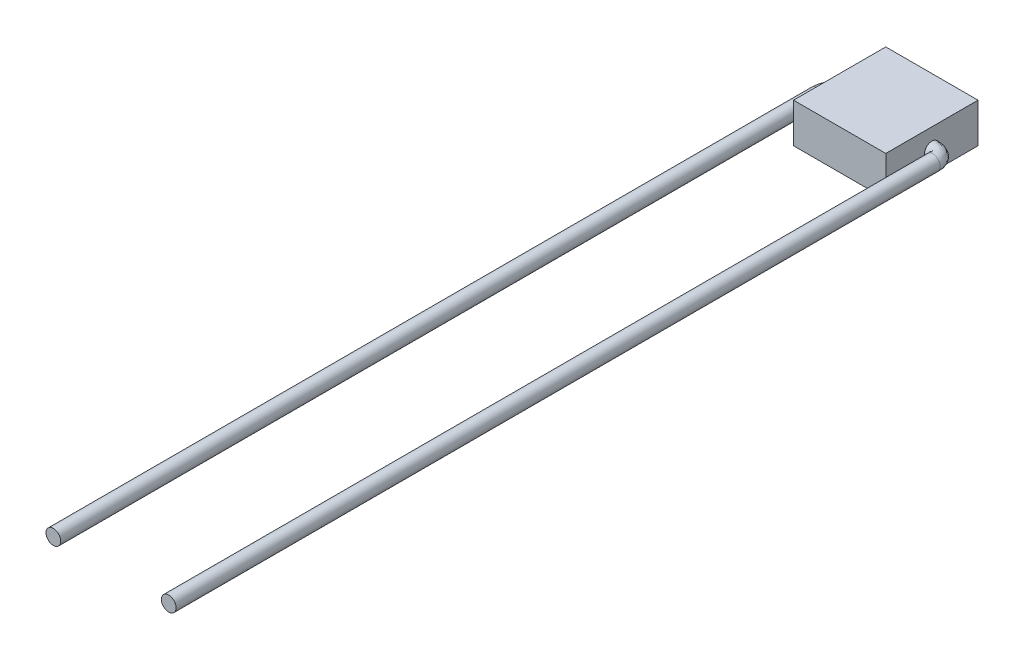
ISO-10303-21;
HEADER;
FILE_DESCRIPTION(('STEP AP214'),'2;1');
FILE_NAME('part.step','',(''),(''),'','','');
FILE_SCHEMA(('AUTOMOTIVE_DESIGN { 1 0 10303 214 1 1 1 1 }'));
ENDSEC;
DATA;
#1=APPLICATION_CONTEXT('core data for automotive mechanical design processes');
#2=APPLICATION_PROTOCOL_DEFINITION('international standard','automotive_design',2000,#1);
#3=PRODUCT_CONTEXT('',#1,'mechanical');
#4=PRODUCT('Part','Part','',(#3));
#5=PRODUCT_RELATED_PRODUCT_CATEGORY('part','',(#4));
#6=PRODUCT_DEFINITION_FORMATION('','',#4);
#7=PRODUCT_DEFINITION_CONTEXT('part definition',#1,'design');
#8=PRODUCT_DEFINITION('design','',#6,#7);
#9=PRODUCT_DEFINITION_SHAPE('','',#8);
#10=(LENGTH_UNIT() NAMED_UNIT(*) SI_UNIT(.MILLI.,.METRE.));
#11=(NAMED_UNIT(*) PLANE_ANGLE_UNIT() SI_UNIT($,.RADIAN.));
#12=(NAMED_UNIT(*) SI_UNIT($,.STERADIAN.) SOLID_ANGLE_UNIT());
#13=UNCERTAINTY_MEASURE_WITH_UNIT(LENGTH_MEASURE(1.E-05),#10,'distance_accuracy_value','');
#14=(GEOMETRIC_REPRESENTATION_CONTEXT(3) GLOBAL_UNCERTAINTY_ASSIGNED_CONTEXT((#13)) GLOBAL_UNIT_ASSIGNED_CONTEXT((#10,
#11,#12)) REPRESENTATION_CONTEXT('',''));
#15=CARTESIAN_POINT('',(0.,0.,0.));
#16=DIRECTION('',(0.,0.,1.));
#17=DIRECTION('',(1.,0.,0.));
#18=AXIS2_PLACEMENT_3D('',#15,#16,#17);
#19=CARTESIAN_POINT('',(-3.501,1.5,-0.559999999999999));
#20=CARTESIAN_POINT('',(-3.57077086192538,1.5,-0.55747201386203));
#21=CARTESIAN_POINT('',(-3.70464029487485,1.5,-0.552621563954215));
#22=CARTESIAN_POINT('',(-3.91057383124204,1.5,-0.522110787828596));
#23=CARTESIAN_POINT('',(-4.11066868138705,1.5,-0.46971702106323));
#24=CARTESIAN_POINT('',(-4.30488379513025,1.5,-0.388880832683943));
#25=CARTESIAN_POINT('',(-4.48850437092492,1.5,-0.274175744233258));
#26=CARTESIAN_POINT('',(-4.66106295964431,1.5,-0.114314040815334));
#27=CARTESIAN_POINT('',(-4.80258904414648,1.5,0.0902926027950877));
#28=CARTESIAN_POINT('',(-4.89704986157643,1.5,0.331803945338373));
#29=CARTESIAN_POINT('',(-4.9407636821338,1.5,0.578221966011214));
#30=CARTESIAN_POINT('',(-4.93808150430951,1.5,0.730850955853715));
#31=CARTESIAN_POINT('',(-4.93668627987886,1.5,0.8102460256088));
#32=CARTESIAN_POINT('',(-3.501,2.62,-0.559999999999999));
#33=CARTESIAN_POINT('',(-3.57077086192538,2.62,-0.55747201386203));
#34=CARTESIAN_POINT('',(-3.70464029487485,2.62,-0.552621563954216));
#35=CARTESIAN_POINT('',(-3.91057383124204,2.62,-0.522110787828596));
#36=CARTESIAN_POINT('',(-4.11066868138705,2.62,-0.469717021063229));
#37=CARTESIAN_POINT('',(-4.30488379513026,2.62,-0.388880832683943));
#38=CARTESIAN_POINT('',(-4.48850437092491,2.62,-0.274175744233258));
#39=CARTESIAN_POINT('',(-4.66106295964431,2.62,-0.114314040815333));
#40=CARTESIAN_POINT('',(-4.80258904414648,2.62,0.0902926027950873));
#41=CARTESIAN_POINT('',(-4.89704986157643,2.62,0.331803945338373));
#42=CARTESIAN_POINT('',(-4.9407636821338,2.62,0.578221966011214));
#43=CARTESIAN_POINT('',(-4.93808150430951,2.62,0.730850955853715));
#44=CARTESIAN_POINT('',(-4.93668627987886,2.62,0.8102460256088));
#45=CARTESIAN_POINT('',(-3.501,2.62,0.560000000000001));
#46=CARTESIAN_POINT('',(-3.5410215522219,2.62,0.561978864055828));
#47=CARTESIAN_POINT('',(-3.61781095045856,2.62,0.565775712793645));
#48=CARTESIAN_POINT('',(-3.70798338071088,2.62,0.581838897980365));
#49=CARTESIAN_POINT('',(-3.77086219618417,2.62,0.601230132123268));
#50=CARTESIAN_POINT('',(-3.80597549757706,2.62,0.619546499124088));
#51=CARTESIAN_POINT('',(-3.81795400080961,2.62,0.631204501510863));
#52=CARTESIAN_POINT('',(-3.81607223827673,2.62,0.634389914440076));
#53=CARTESIAN_POINT('',(-3.81172378294138,2.62,0.633227530091476));
#54=CARTESIAN_POINT('',(-3.8145648973864,2.62,0.647233205299211));
#55=CARTESIAN_POINT('',(-3.82117636953188,2.62,0.691295370718697));
#56=CARTESIAN_POINT('',(-3.81852568511852,2.62,0.746864061766419));
#57=CARTESIAN_POINT('',(-3.81714684303803,2.62,0.775769973457804));
#58=CARTESIAN_POINT('',(-3.501,1.5,0.560000000000001));
#59=CARTESIAN_POINT('',(-3.5410215522219,1.5,0.561978864055829));
#60=CARTESIAN_POINT('',(-3.61781095045856,1.5,0.565775712793645));
#61=CARTESIAN_POINT('',(-3.70798338071088,1.5,0.581838897980364));
#62=CARTESIAN_POINT('',(-3.77086219618417,1.5,0.601230132123269));
#63=CARTESIAN_POINT('',(-3.80597549757706,1.5,0.619546499124087));
#64=CARTESIAN_POINT('',(-3.81795400080961,1.5,0.631204501510863));
#65=CARTESIAN_POINT('',(-3.81607223827673,1.5,0.634389914440077));
#66=CARTESIAN_POINT('',(-3.81172378294138,1.5,0.633227530091476));
#67=CARTESIAN_POINT('',(-3.8145648973864,1.5,0.647233205299211));
#68=CARTESIAN_POINT('',(-3.82117636953188,1.5,0.691295370718697));
#69=CARTESIAN_POINT('',(-3.81852568511852,1.5,0.746864061766419));
#70=CARTESIAN_POINT('',(-3.81714684303803,1.5,0.775769973457804));
#71=CARTESIAN_POINT('',(-3.501,0.38,0.560000000000001));
#72=CARTESIAN_POINT('',(-3.5410215522219,0.38,0.561978864055829));
#73=CARTESIAN_POINT('',(-3.61781095045856,0.38,0.565775712793645));
#74=CARTESIAN_POINT('',(-3.70798338071088,0.38,0.581838897980365));
#75=CARTESIAN_POINT('',(-3.77086219618417,0.38,0.601230132123268));
#76=CARTESIAN_POINT('',(-3.80597549757706,0.38,0.619546499124088));
#77=CARTESIAN_POINT('',(-3.81795400080961,0.38,0.631204501510863));
#78=CARTESIAN_POINT('',(-3.81607223827673,0.38,0.634389914440078));
#79=CARTESIAN_POINT('',(-3.81172378294138,0.38,0.633227530091476));
#80=CARTESIAN_POINT('',(-3.8145648973864,0.38,0.647233205299211));
#81=CARTESIAN_POINT('',(-3.82117636953188,0.38,0.691295370718697));
#82=CARTESIAN_POINT('',(-3.81852568511852,0.38,0.746864061766419));
#83=CARTESIAN_POINT('',(-3.81714684303803,0.38,0.775769973457804));
#84=CARTESIAN_POINT('',(-3.501,0.38,-0.559999999999999));
#85=CARTESIAN_POINT('',(-3.57077086192538,0.38,-0.55747201386203));
#86=CARTESIAN_POINT('',(-3.70464029487485,0.38,-0.552621563954216));
#87=CARTESIAN_POINT('',(-3.91057383124204,0.38,-0.522110787828596));
#88=CARTESIAN_POINT('',(-4.11066868138705,0.38,-0.469717021063229));
#89=CARTESIAN_POINT('',(-4.30488379513026,0.38,-0.388880832683943));
#90=CARTESIAN_POINT('',(-4.48850437092491,0.38,-0.274175744233258));
#91=CARTESIAN_POINT('',(-4.66106295964431,0.38,-0.114314040815333));
#92=CARTESIAN_POINT('',(-4.80258904414648,0.38,0.0902926027950873));
#93=CARTESIAN_POINT('',(-4.89704986157643,0.38,0.331803945338373));
#94=CARTESIAN_POINT('',(-4.9407636821338,0.38,0.578221966011214));
#95=CARTESIAN_POINT('',(-4.93808150430951,0.38,0.730850955853715));
#96=CARTESIAN_POINT('',(-4.93668627987886,0.38,0.8102460256088));
#97=CARTESIAN_POINT('',(-3.501,1.5,-0.559999999999999));
#98=CARTESIAN_POINT('',(-3.57077086192538,1.5,-0.55747201386203));
#99=CARTESIAN_POINT('',(-3.70464029487485,1.5,-0.552621563954215));
#100=CARTESIAN_POINT('',(-3.91057383124204,1.5,-0.522110787828596));
#101=CARTESIAN_POINT('',(-4.11066868138705,1.5,-0.46971702106323));
#102=CARTESIAN_POINT('',(-4.30488379513025,1.5,-0.388880832683943));
#103=CARTESIAN_POINT('',(-4.48850437092492,1.5,-0.274175744233258));
#104=CARTESIAN_POINT('',(-4.66106295964431,1.5,-0.114314040815334));
#105=CARTESIAN_POINT('',(-4.80258904414648,1.5,0.0902926027950877));
#106=CARTESIAN_POINT('',(-4.89704986157643,1.5,0.331803945338373));
#107=CARTESIAN_POINT('',(-4.9407636821338,1.5,0.578221966011214));
#108=CARTESIAN_POINT('',(-4.93808150430951,1.5,0.730850955853715));
#109=CARTESIAN_POINT('',(-4.93668627987886,1.5,0.8102460256088));
#110=(BOUNDED_SURFACE() B_SPLINE_SURFACE(3,3,((#19,#20,#21,#22,#23,#24,#25,#26,#27,#28,#29,#30,
#31),(#32,#33,#34,#35,#36,#37,#38,#39,#40,#41,#42,#43,#44),(#45,#46,#47,#48,#49,#50,#51,#52,#53,
#54,#55,#56,#57),(#58,#59,#60,#61,#62,#63,#64,#65,#66,#67,#68,#69,#70),(#71,#72,#73,#74,#75,#76,
#77,#78,#79,#80,#81,#82,#83),(#84,#85,#86,#87,#88,#89,#90,#91,#92,#93,#94,#95,#96),(#97,#98,#99,
#100,#101,#102,#103,#104,#105,#106,#107,#108,#109)),.UNSPECIFIED.,.T.,.F.,
.F.) B_SPLINE_SURFACE_WITH_KNOTS((4,3,4),(4,1,1,1,1,1,1,1,1,1,4),(0.,0.5,1.),(0.,
0.114428463898639,0.219554025171337,0.31668162093328,0.407421828969413,0.493658937883064,
0.577638288077974,0.676716960010985,0.777579057968776,0.88430031394571,1.),
.UNSPECIFIED.) GEOMETRIC_REPRESENTATION_ITEM() RATIONAL_B_SPLINE_SURFACE(((1.,1.,1.,1.,1.,1.,1.,
1.,1.,1.,1.,1.,1.),(0.333333333333333,0.333333333333333,0.333333333333333,0.333333333333333,
0.333333333333333,0.333333333333333,0.333333333333333,0.333333333333333,0.333333333333333,
0.333333333333333,0.333333333333333,0.333333333333333,0.333333333333333),(0.333333333333333,
0.333333333333333,0.333333333333333,0.333333333333333,0.333333333333333,0.333333333333333,
0.333333333333333,0.333333333333333,0.333333333333333,0.333333333333333,0.333333333333333,
0.333333333333333,0.333333333333333),(1.,1.,1.,1.,1.,1.,1.,1.,1.,1.,1.,1.,1.),
(0.333333333333333,0.333333333333333,0.333333333333333,0.333333333333333,0.333333333333333,
0.333333333333333,0.333333333333333,0.333333333333333,0.333333333333333,0.333333333333333,
0.333333333333333,0.333333333333333,0.333333333333333),(0.333333333333333,0.333333333333333,
0.333333333333333,0.333333333333333,0.333333333333333,0.333333333333333,0.333333333333333,
0.333333333333333,0.333333333333333,0.333333333333333,0.333333333333333,0.333333333333333,
0.333333333333333),(1.,1.,1.,1.,1.,1.,1.,1.,1.,1.,1.,1.,1.))) REPRESENTATION_ITEM('') SURFACE());
#111=CARTESIAN_POINT('',(-3.501,1.5,0.));
#112=DIRECTION('',(1.,0.,0.));
#113=DIRECTION('',(0.,0.,-1.));
#114=AXIS2_PLACEMENT_3D('',#111,#112,#113);
#115=CIRCLE('',#114,0.56);
#116=CARTESIAN_POINT('',(-3.501,1.5,-0.559999999999999));
#117=VERTEX_POINT('',#116);
#118=EDGE_CURVE('E11',#117,#117,#115,.T.);
#119=CARTESIAN_POINT('',(-4.93668627987886,1.5,0.8102460256088));
#120=CARTESIAN_POINT('',(-4.93668627987886,0.38,0.8102460256088));
#121=CARTESIAN_POINT('',(-3.81714684303803,0.38,0.775769973457804));
#122=CARTESIAN_POINT('',(-3.81714684303803,1.5,0.775769973457804));
#123=CARTESIAN_POINT('',(-3.81714684303803,2.62,0.775769973457804));
#124=CARTESIAN_POINT('',(-4.93668627987886,2.62,0.8102460256088));
#125=CARTESIAN_POINT('',(-4.93668627987886,1.5,0.8102460256088));
#126=(BOUNDED_CURVE() B_SPLINE_CURVE(3,(#119,#120,#121,#122,#123,#124,#125),.UNSPECIFIED.,.T.,
.F.) B_SPLINE_CURVE_WITH_KNOTS((4,3,4),(0.,0.5,1.),
.UNSPECIFIED.) CURVE() GEOMETRIC_REPRESENTATION_ITEM() RATIONAL_B_SPLINE_CURVE((1.,
0.333333333333333,0.333333333333333,1.,0.333333333333333,0.333333333333333,1.)) REPRESENTATION_ITEM(''));
#127=CARTESIAN_POINT('',(-4.93668627987886,1.5,0.8102460256088));
#128=VERTEX_POINT('',#127);
#129=EDGE_CURVE('E54',#128,#128,#126,.T.);
#130=ORIENTED_EDGE('',*,*,#118,.F.);
#131=EDGE_LOOP('',(#130));
#132=FACE_BOUND('',#131,.T.);
#133=ORIENTED_EDGE('',*,*,#129,.F.);
#134=EDGE_LOOP('',(#133));
#135=FACE_BOUND('',#134,.T.);
#136=ADVANCED_FACE('F42',(#132,#135),#110,.F.);
#137=CARTESIAN_POINT('',(-3.501,1.5,0.));
#138=DIRECTION('',(-1.,0.,0.));
#139=DIRECTION('',(0.,0.,-1.));
#140=AXIS2_PLACEMENT_3D('',#137,#138,#139);
#141=PLANE('',#140);
#142=ORIENTED_EDGE('',*,*,#118,.T.);
#143=EDGE_LOOP('',(#142));
#144=FACE_BOUND('',#143,.T.);
#145=ADVANCED_FACE('F74',(#144),#141,.F.);
#146=CARTESIAN_POINT('',(-3.81714684303803,1.5,58.7930079995333));
#147=DIRECTION('',(0.,0.,1.));
#148=DIRECTION('',(-1.,0.,0.));
#149=AXIS2_PLACEMENT_3D('',#146,#147,#148);
#150=PLANE('',#149);
#151=CARTESIAN_POINT('',(-4.93668627987886,1.5,58.7930079995333));
#152=CARTESIAN_POINT('',(-4.93668627987886,0.38,58.7930079995333));
#153=CARTESIAN_POINT('',(-3.81714684303803,0.38,58.7930079995333));
#154=CARTESIAN_POINT('',(-3.81714684303803,1.5,58.7930079995333));
#155=CARTESIAN_POINT('',(-3.81714684303803,2.62,58.7930079995333));
#156=CARTESIAN_POINT('',(-4.93668627987886,2.62,58.7930079995333));
#157=CARTESIAN_POINT('',(-4.93668627987886,1.5,58.7930079995333));
#158=(BOUNDED_CURVE() B_SPLINE_CURVE(3,(#151,#152,#153,#154,#155,#156,#157),.UNSPECIFIED.,.T.,
.F.) B_SPLINE_CURVE_WITH_KNOTS((4,3,4),(0.,0.5,1.),
.UNSPECIFIED.) CURVE() GEOMETRIC_REPRESENTATION_ITEM() RATIONAL_B_SPLINE_CURVE((1.,
0.333333333333333,0.333333333333333,1.,0.333333333333333,0.333333333333333,1.)) REPRESENTATION_ITEM(''));
#159=CARTESIAN_POINT('',(-4.93668627987886,1.5,58.7930079995333));
#160=VERTEX_POINT('',#159);
#161=EDGE_CURVE('E50',#160,#160,#158,.F.);
#162=ORIENTED_EDGE('',*,*,#161,.F.);
#163=EDGE_LOOP('',(#162));
#164=FACE_BOUND('',#163,.T.);
#165=ADVANCED_FACE('F79',(#164),#150,.T.);
#166=CARTESIAN_POINT('',(-4.93668627987886,1.5,0.8102460256088));
#167=CARTESIAN_POINT('',(-4.93668627987886,1.5,58.7930079995333));
#168=CARTESIAN_POINT('',(-4.93668627987886,0.38,0.8102460256088));
#169=CARTESIAN_POINT('',(-4.93668627987886,0.38,58.7930079995333));
#170=CARTESIAN_POINT('',(-3.81714684303803,0.38,0.775769973457804));
#171=CARTESIAN_POINT('',(-3.81714684303803,0.38,58.7930079995333));
#172=CARTESIAN_POINT('',(-3.81714684303803,1.5,0.775769973457804));
#173=CARTESIAN_POINT('',(-3.81714684303803,1.5,58.7930079995333));
#174=CARTESIAN_POINT('',(-3.81714684303803,2.62,0.775769973457804));
#175=CARTESIAN_POINT('',(-3.81714684303803,2.62,58.7930079995333));
#176=CARTESIAN_POINT('',(-4.93668627987886,2.62,0.8102460256088));
#177=CARTESIAN_POINT('',(-4.93668627987886,2.62,58.7930079995333));
#178=CARTESIAN_POINT('',(-4.93668627987886,1.5,0.8102460256088));
#179=CARTESIAN_POINT('',(-4.93668627987886,1.5,58.7930079995333));
#180=(BOUNDED_SURFACE() B_SPLINE_SURFACE(3,1,((#166,#167),(#168,#169),(#170,#171),(#172,#173),
(#174,#175),(#176,#177),(#178,#179)),.UNSPECIFIED.,.T.,.F.,.F.) B_SPLINE_SURFACE_WITH_KNOTS((4,
3,4),(2,2),(0.,0.5,1.),(0.,1.),
.UNSPECIFIED.) GEOMETRIC_REPRESENTATION_ITEM() RATIONAL_B_SPLINE_SURFACE(((1.,1.),
(0.333333333333333,0.333333333333333),(0.333333333333333,0.333333333333333),(1.,1.),
(0.333333333333333,0.333333333333333),(0.333333333333333,0.333333333333333),(1.,1.))) REPRESENTATION_ITEM('') SURFACE());
#181=ORIENTED_EDGE('',*,*,#129,.T.);
#182=EDGE_LOOP('',(#181));
#183=FACE_BOUND('',#182,.T.);
#184=ORIENTED_EDGE('',*,*,#161,.T.);
#185=EDGE_LOOP('',(#184));
#186=FACE_BOUND('',#185,.T.);
#187=ADVANCED_FACE('F71',(#183,#186),#180,.T.);
#188=CLOSED_SHELL('',(#136,#145,#165,#187));
#189=MANIFOLD_SOLID_BREP('B2',#188);
#190=CARTESIAN_POINT('',(3.501,1.5,-0.56));
#191=CARTESIAN_POINT('',(3.57077086192538,1.5,-0.55747201386203));
#192=CARTESIAN_POINT('',(3.70464029487485,1.5,-0.552621563954216));
#193=CARTESIAN_POINT('',(3.91057383124204,1.5,-0.522110787828597));
#194=CARTESIAN_POINT('',(4.11066868138705,1.5,-0.46971702106323));
#195=CARTESIAN_POINT('',(4.30488379513025,1.5,-0.388880832683943));
#196=CARTESIAN_POINT('',(4.48850437092492,1.5,-0.274175744233259));
#197=CARTESIAN_POINT('',(4.66106295964431,1.5,-0.114314040815335));
#198=CARTESIAN_POINT('',(4.80258904414648,1.5,0.0902926027950871));
#199=CARTESIAN_POINT('',(4.89704986157643,1.5,0.331803945338372));
#200=CARTESIAN_POINT('',(4.9407636821338,1.5,0.578221966011213));
#201=CARTESIAN_POINT('',(4.93808150430951,1.5,0.730850955853715));
#202=CARTESIAN_POINT('',(4.93668627987886,1.5,0.8102460256088));
#203=CARTESIAN_POINT('',(3.501,2.62,-0.56));
#204=CARTESIAN_POINT('',(3.57077086192538,2.62,-0.557472013862031));
#205=CARTESIAN_POINT('',(3.70464029487485,2.62,-0.552621563954216));
#206=CARTESIAN_POINT('',(3.91057383124204,2.62,-0.522110787828596));
#207=CARTESIAN_POINT('',(4.11066868138705,2.62,-0.46971702106323));
#208=CARTESIAN_POINT('',(4.30488379513026,2.62,-0.388880832683943));
#209=CARTESIAN_POINT('',(4.48850437092491,2.62,-0.274175744233258));
#210=CARTESIAN_POINT('',(4.66106295964431,2.62,-0.114314040815334));
#211=CARTESIAN_POINT('',(4.80258904414648,2.62,0.0902926027950867));
#212=CARTESIAN_POINT('',(4.89704986157643,2.62,0.331803945338373));
#213=CARTESIAN_POINT('',(4.9407636821338,2.62,0.578221966011213));
#214=CARTESIAN_POINT('',(4.93808150430951,2.62,0.730850955853714));
#215=CARTESIAN_POINT('',(4.93668627987886,2.62,0.8102460256088));
#216=CARTESIAN_POINT('',(3.501,2.62,0.56));
#217=CARTESIAN_POINT('',(3.5410215522219,2.62,0.561978864055828));
#218=CARTESIAN_POINT('',(3.61781095045856,2.62,0.565775712793645));
#219=CARTESIAN_POINT('',(3.70798338071088,2.62,0.581838897980364));
#220=CARTESIAN_POINT('',(3.77086219618417,2.62,0.601230132123267));
#221=CARTESIAN_POINT('',(3.80597549757706,2.62,0.619546499124087));
#222=CARTESIAN_POINT('',(3.81795400080961,2.62,0.631204501510863));
#223=CARTESIAN_POINT('',(3.81607223827673,2.62,0.634389914440076));
#224=CARTESIAN_POINT('',(3.81172378294138,2.62,0.633227530091475));
#225=CARTESIAN_POINT('',(3.8145648973864,2.62,0.64723320529921));
#226=CARTESIAN_POINT('',(3.82117636953188,2.62,0.691295370718697));
#227=CARTESIAN_POINT('',(3.81852568511852,2.62,0.746864061766418));
#228=CARTESIAN_POINT('',(3.81714684303803,2.62,0.775769973457804));
#229=CARTESIAN_POINT('',(3.501,1.5,0.56));
#230=CARTESIAN_POINT('',(3.5410215522219,1.5,0.561978864055828));
#231=CARTESIAN_POINT('',(3.61781095045856,1.5,0.565775712793645));
#232=CARTESIAN_POINT('',(3.70798338071088,1.5,0.581838897980364));
#233=CARTESIAN_POINT('',(3.77086219618417,1.5,0.601230132123268));
#234=CARTESIAN_POINT('',(3.80597549757706,1.5,0.619546499124087));
#235=CARTESIAN_POINT('',(3.81795400080961,1.5,0.631204501510862));
#236=CARTESIAN_POINT('',(3.81607223827673,1.5,0.634389914440076));
#237=CARTESIAN_POINT('',(3.81172378294138,1.5,0.633227530091475));
#238=CARTESIAN_POINT('',(3.8145648973864,1.5,0.64723320529921));
#239=CARTESIAN_POINT('',(3.82117636953188,1.5,0.691295370718697));
#240=CARTESIAN_POINT('',(3.81852568511852,1.5,0.746864061766418));
#241=CARTESIAN_POINT('',(3.81714684303803,1.5,0.775769973457804));
#242=CARTESIAN_POINT('',(3.501,0.38,0.56));
#243=CARTESIAN_POINT('',(3.5410215522219,0.38,0.561978864055828));
#244=CARTESIAN_POINT('',(3.61781095045856,0.38,0.565775712793645));
#245=CARTESIAN_POINT('',(3.70798338071088,0.38,0.581838897980365));
#246=CARTESIAN_POINT('',(3.77086219618417,0.38,0.601230132123267));
#247=CARTESIAN_POINT('',(3.80597549757706,0.38,0.619546499124088));
#248=CARTESIAN_POINT('',(3.81795400080961,0.38,0.631204501510862));
#249=CARTESIAN_POINT('',(3.81607223827673,0.38,0.634389914440077));
#250=CARTESIAN_POINT('',(3.81172378294138,0.38,0.633227530091475));
#251=CARTESIAN_POINT('',(3.8145648973864,0.38,0.64723320529921));
#252=CARTESIAN_POINT('',(3.82117636953188,0.38,0.691295370718697));
#253=CARTESIAN_POINT('',(3.81852568511852,0.38,0.746864061766418));
#254=CARTESIAN_POINT('',(3.81714684303803,0.38,0.775769973457804));
#255=CARTESIAN_POINT('',(3.501,0.38,-0.56));
#256=CARTESIAN_POINT('',(3.57077086192538,0.38,-0.557472013862031));
#257=CARTESIAN_POINT('',(3.70464029487485,0.38,-0.552621563954216));
#258=CARTESIAN_POINT('',(3.91057383124204,0.38,-0.522110787828596));
#259=CARTESIAN_POINT('',(4.11066868138705,0.38,-0.46971702106323));
#260=CARTESIAN_POINT('',(4.30488379513026,0.38,-0.388880832683943));
#261=CARTESIAN_POINT('',(4.48850437092491,0.38,-0.274175744233258));
#262=CARTESIAN_POINT('',(4.66106295964431,0.38,-0.114314040815334));
#263=CARTESIAN_POINT('',(4.80258904414648,0.38,0.0902926027950867));
#264=CARTESIAN_POINT('',(4.89704986157643,0.38,0.331803945338373));
#265=CARTESIAN_POINT('',(4.9407636821338,0.38,0.578221966011213));
#266=CARTESIAN_POINT('',(4.93808150430951,0.38,0.730850955853714));
#267=CARTESIAN_POINT('',(4.93668627987886,0.38,0.8102460256088));
#268=CARTESIAN_POINT('',(3.501,1.5,-0.56));
#269=CARTESIAN_POINT('',(3.57077086192538,1.5,-0.55747201386203));
#270=CARTESIAN_POINT('',(3.70464029487485,1.5,-0.552621563954216));
#271=CARTESIAN_POINT('',(3.91057383124204,1.5,-0.522110787828597));
#272=CARTESIAN_POINT('',(4.11066868138705,1.5,-0.46971702106323));
#273=CARTESIAN_POINT('',(4.30488379513025,1.5,-0.388880832683943));
#274=CARTESIAN_POINT('',(4.48850437092492,1.5,-0.274175744233259));
#275=CARTESIAN_POINT('',(4.66106295964431,1.5,-0.114314040815335));
#276=CARTESIAN_POINT('',(4.80258904414648,1.5,0.0902926027950871));
#277=CARTESIAN_POINT('',(4.89704986157643,1.5,0.331803945338372));
#278=CARTESIAN_POINT('',(4.9407636821338,1.5,0.578221966011213));
#279=CARTESIAN_POINT('',(4.93808150430951,1.5,0.730850955853715));
#280=CARTESIAN_POINT('',(4.93668627987886,1.5,0.8102460256088));
#281=(BOUNDED_SURFACE() B_SPLINE_SURFACE(3,3,((#190,#191,#192,#193,#194,#195,#196,#197,#198,
#199,#200,#201,#202),(#203,#204,#205,#206,#207,#208,#209,#210,#211,#212,#213,#214,#215),(#216,
#217,#218,#219,#220,#221,#222,#223,#224,#225,#226,#227,#228),(#229,#230,#231,#232,#233,#234,
#235,#236,#237,#238,#239,#240,#241),(#242,#243,#244,#245,#246,#247,#248,#249,#250,#251,#252,
#253,#254),(#255,#256,#257,#258,#259,#260,#261,#262,#263,#264,#265,#266,#267),(#268,#269,#270,
#271,#272,#273,#274,#275,#276,#277,#278,#279,#280)),.UNSPECIFIED.,.T.,.F.,
.F.) B_SPLINE_SURFACE_WITH_KNOTS((4,3,4),(4,1,1,1,1,1,1,1,1,1,4),(0.,0.5,1.),(0.,
0.114428463898639,0.219554025171337,0.31668162093328,0.407421828969413,0.493658937883064,
0.577638288077974,0.676716960010985,0.777579057968776,0.88430031394571,1.),
.UNSPECIFIED.) GEOMETRIC_REPRESENTATION_ITEM() RATIONAL_B_SPLINE_SURFACE(((1.,1.,1.,1.,1.,1.,1.,
1.,1.,1.,1.,1.,1.),(0.333333333333333,0.333333333333333,0.333333333333333,0.333333333333333,
0.333333333333333,0.333333333333333,0.333333333333333,0.333333333333333,0.333333333333333,
0.333333333333333,0.333333333333333,0.333333333333333,0.333333333333333),(0.333333333333333,
0.333333333333333,0.333333333333333,0.333333333333333,0.333333333333333,0.333333333333333,
0.333333333333333,0.333333333333333,0.333333333333333,0.333333333333333,0.333333333333333,
0.333333333333333,0.333333333333333),(1.,1.,1.,1.,1.,1.,1.,1.,1.,1.,1.,1.,1.),
(0.333333333333333,0.333333333333333,0.333333333333333,0.333333333333333,0.333333333333333,
0.333333333333333,0.333333333333333,0.333333333333333,0.333333333333333,0.333333333333333,
0.333333333333333,0.333333333333333,0.333333333333333),(0.333333333333333,0.333333333333333,
0.333333333333333,0.333333333333333,0.333333333333333,0.333333333333333,0.333333333333333,
0.333333333333333,0.333333333333333,0.333333333333333,0.333333333333333,0.333333333333333,
0.333333333333333),(1.,1.,1.,1.,1.,1.,1.,1.,1.,1.,1.,1.,1.))) REPRESENTATION_ITEM('') SURFACE());
#282=CARTESIAN_POINT('',(3.501,1.5,0.));
#283=DIRECTION('',(1.,0.,0.));
#284=DIRECTION('',(0.,0.,-1.));
#285=AXIS2_PLACEMENT_3D('',#282,#283,#284);
#286=CIRCLE('',#285,0.56);
#287=CARTESIAN_POINT('',(3.501,1.5,-0.56));
#288=VERTEX_POINT('',#287);
#289=EDGE_CURVE('E41',#288,#288,#286,.T.);
#290=CARTESIAN_POINT('',(4.93668627987886,1.5,0.8102460256088));
#291=CARTESIAN_POINT('',(4.93668627987886,0.38,0.8102460256088));
#292=CARTESIAN_POINT('',(3.81714684303803,0.38,0.775769973457804));
#293=CARTESIAN_POINT('',(3.81714684303803,1.5,0.775769973457804));
#294=CARTESIAN_POINT('',(3.81714684303803,2.62,0.775769973457804));
#295=CARTESIAN_POINT('',(4.93668627987886,2.62,0.8102460256088));
#296=CARTESIAN_POINT('',(4.93668627987886,1.5,0.8102460256088));
#297=(BOUNDED_CURVE() B_SPLINE_CURVE(3,(#290,#291,#292,#293,#294,#295,#296),.UNSPECIFIED.,.T.,
.F.) B_SPLINE_CURVE_WITH_KNOTS((4,3,4),(0.,0.5,1.),
.UNSPECIFIED.) CURVE() GEOMETRIC_REPRESENTATION_ITEM() RATIONAL_B_SPLINE_CURVE((1.,
0.333333333333333,0.333333333333333,1.,0.333333333333333,0.333333333333333,1.)) REPRESENTATION_ITEM(''));
#298=CARTESIAN_POINT('',(4.93668627987886,1.5,0.8102460256088));
#299=VERTEX_POINT('',#298);
#300=EDGE_CURVE('E143',#299,#299,#297,.T.);
#301=ORIENTED_EDGE('',*,*,#289,.T.);
#302=EDGE_LOOP('',(#301));
#303=FACE_BOUND('',#302,.T.);
#304=ORIENTED_EDGE('',*,*,#300,.T.);
#305=EDGE_LOOP('',(#304));
#306=FACE_BOUND('',#305,.T.);
#307=ADVANCED_FACE('F131',(#303,#306),#281,.T.);
#308=CARTESIAN_POINT('',(3.501,1.5,0.));
#309=DIRECTION('',(1.,0.,0.));
#310=DIRECTION('',(0.,0.,-1.));
#311=AXIS2_PLACEMENT_3D('',#308,#309,#310);
#312=PLANE('',#311);
#313=ORIENTED_EDGE('',*,*,#289,.F.);
#314=EDGE_LOOP('',(#313));
#315=FACE_BOUND('',#314,.T.);
#316=ADVANCED_FACE('F169',(#315),#312,.F.);
#317=CARTESIAN_POINT('',(3.81714684303804,1.5,58.7930079995333));
#318=DIRECTION('',(0.,0.,1.));
#319=DIRECTION('',(1.,0.,0.));
#320=AXIS2_PLACEMENT_3D('',#317,#318,#319);
#321=PLANE('',#320);
#322=CARTESIAN_POINT('',(4.93668627987886,1.5,58.7930079995333));
#323=CARTESIAN_POINT('',(4.93668627987886,0.38,58.7930079995333));
#324=CARTESIAN_POINT('',(3.81714684303804,0.38,58.7930079995333));
#325=CARTESIAN_POINT('',(3.81714684303804,1.5,58.7930079995333));
#326=CARTESIAN_POINT('',(3.81714684303804,2.62,58.7930079995333));
#327=CARTESIAN_POINT('',(4.93668627987886,2.62,58.7930079995333));
#328=CARTESIAN_POINT('',(4.93668627987886,1.5,58.7930079995333));
#329=(BOUNDED_CURVE() B_SPLINE_CURVE(3,(#322,#323,#324,#325,#326,#327,#328),.UNSPECIFIED.,.T.,
.F.) B_SPLINE_CURVE_WITH_KNOTS((4,3,4),(0.,0.5,1.),
.UNSPECIFIED.) CURVE() GEOMETRIC_REPRESENTATION_ITEM() RATIONAL_B_SPLINE_CURVE((1.,
0.333333333333333,0.333333333333333,1.,0.333333333333333,0.333333333333333,1.)) REPRESENTATION_ITEM(''));
#330=CARTESIAN_POINT('',(4.93668627987886,1.5,58.7930079995333));
#331=VERTEX_POINT('',#330);
#332=EDGE_CURVE('E139',#331,#331,#329,.F.);
#333=ORIENTED_EDGE('',*,*,#332,.T.);
#334=EDGE_LOOP('',(#333));
#335=FACE_BOUND('',#334,.T.);
#336=ADVANCED_FACE('F164',(#335),#321,.T.);
#337=CARTESIAN_POINT('',(4.93668627987886,1.5,0.8102460256088));
#338=CARTESIAN_POINT('',(4.93668627987886,1.5,58.7930079995333));
#339=CARTESIAN_POINT('',(4.93668627987886,0.38,0.8102460256088));
#340=CARTESIAN_POINT('',(4.93668627987886,0.38,58.7930079995333));
#341=CARTESIAN_POINT('',(3.81714684303803,0.38,0.775769973457804));
#342=CARTESIAN_POINT('',(3.81714684303804,0.38,58.7930079995333));
#343=CARTESIAN_POINT('',(3.81714684303803,1.5,0.775769973457804));
#344=CARTESIAN_POINT('',(3.81714684303804,1.5,58.7930079995333));
#345=CARTESIAN_POINT('',(3.81714684303803,2.62,0.775769973457804));
#346=CARTESIAN_POINT('',(3.81714684303804,2.62,58.7930079995333));
#347=CARTESIAN_POINT('',(4.93668627987886,2.62,0.8102460256088));
#348=CARTESIAN_POINT('',(4.93668627987886,2.62,58.7930079995333));
#349=CARTESIAN_POINT('',(4.93668627987886,1.5,0.8102460256088));
#350=CARTESIAN_POINT('',(4.93668627987886,1.5,58.7930079995333));
#351=(BOUNDED_SURFACE() B_SPLINE_SURFACE(3,1,((#337,#338),(#339,#340),(#341,#342),(#343,#344),
(#345,#346),(#347,#348),(#349,#350)),.UNSPECIFIED.,.T.,.F.,.F.) B_SPLINE_SURFACE_WITH_KNOTS((4,
3,4),(2,2),(0.,0.5,1.),(0.,1.),
.UNSPECIFIED.) GEOMETRIC_REPRESENTATION_ITEM() RATIONAL_B_SPLINE_SURFACE(((1.,1.),
(0.333333333333333,0.333333333333333),(0.333333333333333,0.333333333333333),(1.,1.),
(0.333333333333333,0.333333333333333),(0.333333333333333,0.333333333333333),(1.,1.))) REPRESENTATION_ITEM('') SURFACE());
#352=ORIENTED_EDGE('',*,*,#300,.F.);
#353=EDGE_LOOP('',(#352));
#354=FACE_BOUND('',#353,.T.);
#355=ORIENTED_EDGE('',*,*,#332,.F.);
#356=EDGE_LOOP('',(#355));
#357=FACE_BOUND('',#356,.T.);
#358=ADVANCED_FACE('F161',(#354,#357),#351,.F.);
#359=CLOSED_SHELL('',(#307,#316,#336,#358));
#360=MANIFOLD_SOLID_BREP('B6',#359);
#361=CARTESIAN_POINT('',(-3.5,3.,-3.5));
#362=DIRECTION('',(1.,0.,0.));
#363=DIRECTION('',(0.,0.,-1.));
#364=AXIS2_PLACEMENT_3D('',#361,#362,#363);
#365=PLANE('',#364);
#366=DIRECTION('',(0.,0.,1.));
#367=VECTOR('',#366,1.);
#368=CARTESIAN_POINT('',(-3.5,0.,-3.5));
#369=LINE('',#368,#367);
#370=CARTESIAN_POINT('',(-3.5,0.,-3.5));
#371=VERTEX_POINT('',#370);
#372=CARTESIAN_POINT('',(-3.5,0.,3.5));
#373=VERTEX_POINT('',#372);
#374=EDGE_CURVE('E274',#371,#373,#369,.T.);
#375=ORIENTED_EDGE('',*,*,#374,.T.);
#376=DIRECTION('',(0.,-1.,0.));
#377=VECTOR('',#376,1.);
#378=CARTESIAN_POINT('',(-3.5,3.,3.5));
#379=LINE('',#378,#377);
#380=CARTESIAN_POINT('',(-3.5,3.,3.5));
#381=VERTEX_POINT('',#380);
#382=EDGE_CURVE('E129',#381,#373,#379,.T.);
#383=ORIENTED_EDGE('',*,*,#382,.F.);
#384=DIRECTION('',(0.,0.,1.));
#385=VECTOR('',#384,1.);
#386=CARTESIAN_POINT('',(-3.5,3.,-3.5));
#387=LINE('',#386,#385);
#388=CARTESIAN_POINT('',(-3.5,3.,-3.5));
#389=VERTEX_POINT('',#388);
#390=EDGE_CURVE('E262',#389,#381,#387,.T.);
#391=ORIENTED_EDGE('',*,*,#390,.F.);
#392=DIRECTION('',(0.,-1.,0.));
#393=VECTOR('',#392,1.);
#394=CARTESIAN_POINT('',(-3.5,3.,-3.5));
#395=LINE('',#394,#393);
#396=EDGE_CURVE('E270',#389,#371,#395,.T.);
#397=ORIENTED_EDGE('',*,*,#396,.T.);
#398=EDGE_LOOP('',(#375,#383,#391,#397));
#399=FACE_BOUND('',#398,.T.);
#400=ADVANCED_FACE('F211',(#399),#365,.F.);
#401=CARTESIAN_POINT('',(-3.5,3.,3.5));
#402=DIRECTION('',(0.,0.,-1.));
#403=DIRECTION('',(-1.,0.,0.));
#404=AXIS2_PLACEMENT_3D('',#401,#402,#403);
#405=PLANE('',#404);
#406=DIRECTION('',(1.,0.,0.));
#407=VECTOR('',#406,1.);
#408=CARTESIAN_POINT('',(-3.5,0.,3.5));
#409=LINE('',#408,#407);
#410=CARTESIAN_POINT('',(3.5,0.,3.5));
#411=VERTEX_POINT('',#410);
#412=EDGE_CURVE('E266',#373,#411,#409,.T.);
#413=ORIENTED_EDGE('',*,*,#412,.T.);
#414=DIRECTION('',(0.,-1.,0.));
#415=VECTOR('',#414,1.);
#416=CARTESIAN_POINT('',(3.5,3.,3.5));
#417=LINE('',#416,#415);
#418=CARTESIAN_POINT('',(3.5,3.,3.5));
#419=VERTEX_POINT('',#418);
#420=EDGE_CURVE('E219',#419,#411,#417,.T.);
#421=ORIENTED_EDGE('',*,*,#420,.F.);
#422=DIRECTION('',(1.,0.,0.));
#423=VECTOR('',#422,1.);
#424=CARTESIAN_POINT('',(-3.5,3.,3.5));
#425=LINE('',#424,#423);
#426=EDGE_CURVE('E257',#381,#419,#425,.T.);
#427=ORIENTED_EDGE('',*,*,#426,.F.);
#428=ORIENTED_EDGE('',*,*,#382,.T.);
#429=EDGE_LOOP('',(#413,#421,#427,#428));
#430=FACE_BOUND('',#429,.T.);
#431=ADVANCED_FACE('F265',(#430),#405,.F.);
#432=CARTESIAN_POINT('',(3.5,3.,-3.5));
#433=DIRECTION('',(-1.,0.,0.));
#434=DIRECTION('',(0.,0.,1.));
#435=AXIS2_PLACEMENT_3D('',#432,#433,#434);
#436=PLANE('',#435);
#437=DIRECTION('',(0.,0.,-1.));
#438=VECTOR('',#437,1.);
#439=CARTESIAN_POINT('',(3.5,0.,-3.5));
#440=LINE('',#439,#438);
#441=CARTESIAN_POINT('',(3.5,0.,-3.5));
#442=VERTEX_POINT('',#441);
#443=EDGE_CURVE('E244',#411,#442,#440,.T.);
#444=ORIENTED_EDGE('',*,*,#443,.T.);
#445=DIRECTION('',(0.,-1.,0.));
#446=VECTOR('',#445,1.);
#447=CARTESIAN_POINT('',(3.5,3.,-3.5));
#448=LINE('',#447,#446);
#449=CARTESIAN_POINT('',(3.5,3.,-3.5));
#450=VERTEX_POINT('',#449);
#451=EDGE_CURVE('E267',#450,#442,#448,.T.);
#452=ORIENTED_EDGE('',*,*,#451,.F.);
#453=DIRECTION('',(0.,0.,-1.));
#454=VECTOR('',#453,1.);
#455=CARTESIAN_POINT('',(3.5,3.,-3.5));
#456=LINE('',#455,#454);
#457=EDGE_CURVE('E260',#419,#450,#456,.T.);
#458=ORIENTED_EDGE('',*,*,#457,.F.);
#459=ORIENTED_EDGE('',*,*,#420,.T.);
#460=EDGE_LOOP('',(#444,#452,#458,#459));
#461=FACE_BOUND('',#460,.T.);
#462=ADVANCED_FACE('F268',(#461),#436,.F.);
#463=CARTESIAN_POINT('',(-3.5,3.,-3.5));
#464=DIRECTION('',(0.,0.,1.));
#465=DIRECTION('',(1.,0.,0.));
#466=AXIS2_PLACEMENT_3D('',#463,#464,#465);
#467=PLANE('',#466);
#468=DIRECTION('',(-1.,0.,0.));
#469=VECTOR('',#468,1.);
#470=CARTESIAN_POINT('',(-3.5,0.,-3.5));
#471=LINE('',#470,#469);
#472=EDGE_CURVE('E250',#442,#371,#471,.T.);
#473=ORIENTED_EDGE('',*,*,#472,.T.);
#474=ORIENTED_EDGE('',*,*,#396,.F.);
#475=DIRECTION('',(-1.,0.,0.));
#476=VECTOR('',#475,1.);
#477=CARTESIAN_POINT('',(-3.5,3.,-3.5));
#478=LINE('',#477,#476);
#479=EDGE_CURVE('E227',#450,#389,#478,.T.);
#480=ORIENTED_EDGE('',*,*,#479,.F.);
#481=ORIENTED_EDGE('',*,*,#451,.T.);
#482=EDGE_LOOP('',(#473,#474,#480,#481));
#483=FACE_BOUND('',#482,.T.);
#484=ADVANCED_FACE('F281',(#483),#467,.F.);
#485=CARTESIAN_POINT('',(0.,3.,0.));
#486=DIRECTION('',(0.,1.,0.));
#487=DIRECTION('',(0.,0.,1.));
#488=AXIS2_PLACEMENT_3D('',#485,#486,#487);
#489=PLANE('',#488);
#490=ORIENTED_EDGE('',*,*,#390,.T.);
#491=ORIENTED_EDGE('',*,*,#426,.T.);
#492=ORIENTED_EDGE('',*,*,#457,.T.);
#493=ORIENTED_EDGE('',*,*,#479,.T.);
#494=EDGE_LOOP('',(#490,#491,#492,#493));
#495=FACE_BOUND('',#494,.T.);
#496=ADVANCED_FACE('F258',(#495),#489,.T.);
#497=CARTESIAN_POINT('',(0.,0.,0.));
#498=DIRECTION('',(0.,1.,0.));
#499=DIRECTION('',(0.,0.,1.));
#500=AXIS2_PLACEMENT_3D('',#497,#498,#499);
#501=PLANE('',#500);
#502=ORIENTED_EDGE('',*,*,#374,.F.);
#503=ORIENTED_EDGE('',*,*,#472,.F.);
#504=ORIENTED_EDGE('',*,*,#443,.F.);
#505=ORIENTED_EDGE('',*,*,#412,.F.);
#506=EDGE_LOOP('',(#502,#503,#504,#505));
#507=FACE_BOUND('',#506,.T.);
#508=ADVANCED_FACE('F284',(#507),#501,.F.);
#509=CLOSED_SHELL('',(#400,#431,#462,#484,#496,#508));
#510=MANIFOLD_SOLID_BREP('B36',#509);
#511=ADVANCED_BREP_SHAPE_REPRESENTATION('',(#18,#189,#360,#510),#14);
#512=SHAPE_DEFINITION_REPRESENTATION(#9,#511);
ENDSEC;
END-ISO-10303-21;
